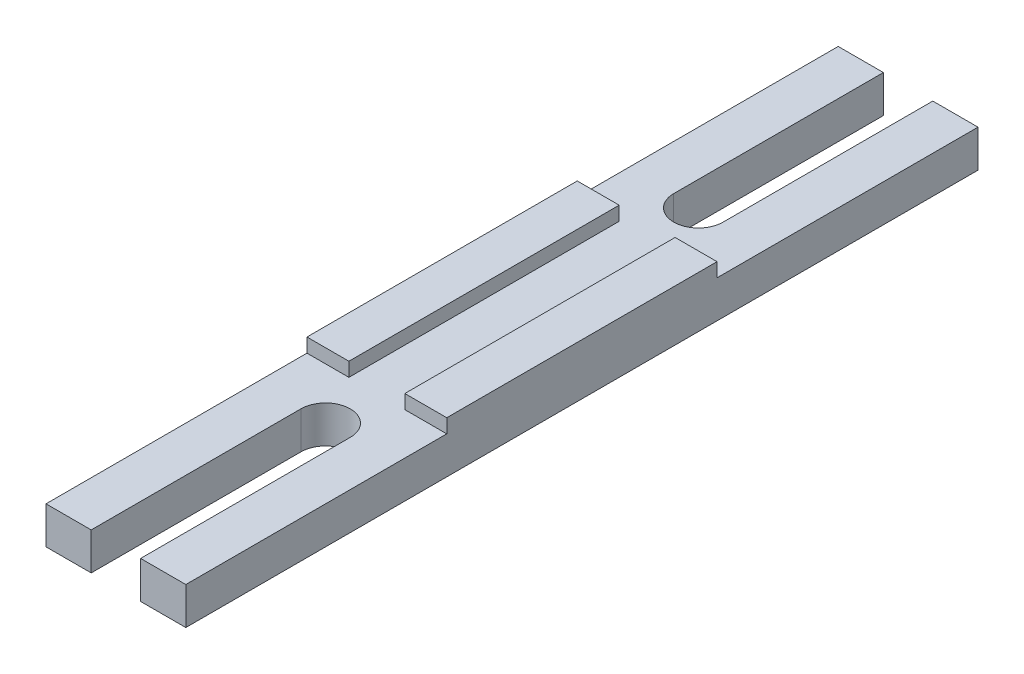
ISO-10303-21;
HEADER;
FILE_DESCRIPTION(('STEP AP214'),'2;1');
FILE_NAME('part.step','',(''),(''),'','','');
FILE_SCHEMA(('AUTOMOTIVE_DESIGN { 1 0 10303 214 1 1 1 1 }'));
ENDSEC;
DATA;
#1=APPLICATION_CONTEXT('core data for automotive mechanical design processes');
#2=APPLICATION_PROTOCOL_DEFINITION('international standard','automotive_design',2000,#1);
#3=PRODUCT_CONTEXT('',#1,'mechanical');
#4=PRODUCT('Part','Part','',(#3));
#5=PRODUCT_RELATED_PRODUCT_CATEGORY('part','',(#4));
#6=PRODUCT_DEFINITION_FORMATION('','',#4);
#7=PRODUCT_DEFINITION_CONTEXT('part definition',#1,'design');
#8=PRODUCT_DEFINITION('design','',#6,#7);
#9=PRODUCT_DEFINITION_SHAPE('','',#8);
#10=(LENGTH_UNIT() NAMED_UNIT(*) SI_UNIT(.MILLI.,.METRE.));
#11=(NAMED_UNIT(*) PLANE_ANGLE_UNIT() SI_UNIT($,.RADIAN.));
#12=(NAMED_UNIT(*) SI_UNIT($,.STERADIAN.) SOLID_ANGLE_UNIT());
#13=UNCERTAINTY_MEASURE_WITH_UNIT(LENGTH_MEASURE(1.E-05),#10,'distance_accuracy_value','');
#14=(GEOMETRIC_REPRESENTATION_CONTEXT(3) GLOBAL_UNCERTAINTY_ASSIGNED_CONTEXT((#13)) GLOBAL_UNIT_ASSIGNED_CONTEXT((#10,
#11,#12)) REPRESENTATION_CONTEXT('',''));
#15=CARTESIAN_POINT('',(0.,0.,0.));
#16=DIRECTION('',(0.,0.,1.));
#17=DIRECTION('',(1.,0.,0.));
#18=AXIS2_PLACEMENT_3D('',#15,#16,#17);
#19=CARTESIAN_POINT('',(-3.,4.,12.51));
#20=DIRECTION('',(-1.,0.,0.));
#21=DIRECTION('',(0.,-1.,0.));
#22=AXIS2_PLACEMENT_3D('',#19,#20,#21);
#23=PLANE('',#22);
#24=DIRECTION('',(0.,0.,-1.));
#25=VECTOR('',#24,1.);
#26=CARTESIAN_POINT('',(-3.,5.50000000000001,-29.5));
#27=LINE('',#26,#25);
#28=CARTESIAN_POINT('',(-3.,5.5,-0.500000000000002));
#29=VERTEX_POINT('',#28);
#30=CARTESIAN_POINT('',(-3.,5.5,-29.5));
#31=VERTEX_POINT('',#30);
#32=EDGE_CURVE('E331',#29,#31,#27,.T.);
#33=ORIENTED_EDGE('',*,*,#32,.F.);
#34=DIRECTION('',(0.,1.,0.));
#35=VECTOR('',#34,1.);
#36=CARTESIAN_POINT('',(-3.,5.5,-0.500000000000002));
#37=LINE('',#36,#35);
#38=CARTESIAN_POINT('',(-3.,3.99999999999999,-0.500000000000003));
#39=VERTEX_POINT('',#38);
#40=EDGE_CURVE('E196',#39,#29,#37,.T.);
#41=ORIENTED_EDGE('',*,*,#40,.F.);
#42=DIRECTION('',(0.,0.,-1.));
#43=VECTOR('',#42,1.);
#44=CARTESIAN_POINT('',(-3.,4.,12.51));
#45=LINE('',#44,#43);
#46=CARTESIAN_POINT('',(-3.,3.99999999999999,-29.5));
#47=VERTEX_POINT('',#46);
#48=EDGE_CURVE('E11',#39,#47,#45,.T.);
#49=ORIENTED_EDGE('',*,*,#48,.T.);
#50=DIRECTION('',(0.,-1.,0.));
#51=VECTOR('',#50,1.);
#52=CARTESIAN_POINT('',(-3.,12.7721259943546,-29.5));
#53=LINE('',#52,#51);
#54=EDGE_CURVE('E392',#31,#47,#53,.T.);
#55=ORIENTED_EDGE('',*,*,#54,.F.);
#56=EDGE_LOOP('',(#33,#41,#49,#55));
#57=FACE_BOUND('',#56,.T.);
#58=ADVANCED_FACE('F44',(#57),#23,.F.);
#59=CARTESIAN_POINT('',(3.,7.8079598766714,12.51));
#60=DIRECTION('',(1.,0.,0.));
#61=DIRECTION('',(0.,1.,0.));
#62=AXIS2_PLACEMENT_3D('',#59,#60,#61);
#63=PLANE('',#62);
#64=DIRECTION('',(0.,0.,-1.));
#65=VECTOR('',#64,1.);
#66=CARTESIAN_POINT('',(3.,5.50000000000001,-15.));
#67=LINE('',#66,#65);
#68=CARTESIAN_POINT('',(3.,5.5,-0.500000000000002));
#69=VERTEX_POINT('',#68);
#70=CARTESIAN_POINT('',(3.,5.50000000000001,-29.5));
#71=VERTEX_POINT('',#70);
#72=EDGE_CURVE('E332',#69,#71,#67,.T.);
#73=ORIENTED_EDGE('',*,*,#72,.T.);
#74=DIRECTION('',(0.,1.,0.));
#75=VECTOR('',#74,1.);
#76=CARTESIAN_POINT('',(3.,12.7721259943546,-29.5));
#77=LINE('',#76,#75);
#78=CARTESIAN_POINT('',(3.,3.99999999999999,-29.5));
#79=VERTEX_POINT('',#78);
#80=EDGE_CURVE('E62',#79,#71,#77,.T.);
#81=ORIENTED_EDGE('',*,*,#80,.F.);
#82=DIRECTION('',(0.,0.,-1.));
#83=VECTOR('',#82,1.);
#84=CARTESIAN_POINT('',(3.,4.,12.51));
#85=LINE('',#84,#83);
#86=CARTESIAN_POINT('',(3.,3.99999999999999,-0.500000000000003));
#87=VERTEX_POINT('',#86);
#88=EDGE_CURVE('E54',#87,#79,#85,.T.);
#89=ORIENTED_EDGE('',*,*,#88,.F.);
#90=DIRECTION('',(0.,-1.,0.));
#91=VECTOR('',#90,1.);
#92=CARTESIAN_POINT('',(3.,5.5,-0.500000000000002));
#93=LINE('',#92,#91);
#94=EDGE_CURVE('E48',#69,#87,#93,.T.);
#95=ORIENTED_EDGE('',*,*,#94,.F.);
#96=EDGE_LOOP('',(#73,#81,#89,#95));
#97=FACE_BOUND('',#96,.T.);
#98=ADVANCED_FACE('F46',(#97),#63,.F.);
#99=CARTESIAN_POINT('',(2.64999999999999,0.,15.));
#100=DIRECTION('',(1.,0.,0.));
#101=DIRECTION('',(0.,0.,-1.));
#102=AXIS2_PLACEMENT_3D('',#99,#100,#101);
#103=PLANE('',#102);
#104=DIRECTION('',(0.,0.,-1.));
#105=VECTOR('',#104,1.);
#106=CARTESIAN_POINT('',(2.65000000000004,0.,-30.));
#107=LINE('',#106,#105);
#108=CARTESIAN_POINT('',(2.65,0.,27.5));
#109=VERTEX_POINT('',#108);
#110=CARTESIAN_POINT('',(2.65,0.,5.));
#111=VERTEX_POINT('',#110);
#112=EDGE_CURVE('E203',#109,#111,#107,.T.);
#113=ORIENTED_EDGE('',*,*,#112,.F.);
#114=DIRECTION('',(0.,1.,0.));
#115=VECTOR('',#114,1.);
#116=CARTESIAN_POINT('',(2.65,-15.7645964109456,27.5));
#117=LINE('',#116,#115);
#118=CARTESIAN_POINT('',(2.65,3.99999999999999,27.5));
#119=VERTEX_POINT('',#118);
#120=EDGE_CURVE('E200',#109,#119,#117,.T.);
#121=ORIENTED_EDGE('',*,*,#120,.T.);
#122=DIRECTION('',(0.,0.,-1.));
#123=VECTOR('',#122,1.);
#124=CARTESIAN_POINT('',(2.64999999999999,4.,15.));
#125=LINE('',#124,#123);
#126=CARTESIAN_POINT('',(2.65,4.,5.));
#127=VERTEX_POINT('',#126);
#128=EDGE_CURVE('E184',#119,#127,#125,.T.);
#129=ORIENTED_EDGE('',*,*,#128,.T.);
#130=DIRECTION('',(0.,1.,0.));
#131=VECTOR('',#130,1.);
#132=CARTESIAN_POINT('',(2.65,0.,5.));
#133=LINE('',#132,#131);
#134=EDGE_CURVE('E362',#111,#127,#133,.T.);
#135=ORIENTED_EDGE('',*,*,#134,.F.);
#136=EDGE_LOOP('',(#113,#121,#129,#135));
#137=FACE_BOUND('',#136,.T.);
#138=ADVANCED_FACE('F201',(#137),#103,.F.);
#139=CARTESIAN_POINT('',(3.,5.5,-0.500000000000002));
#140=DIRECTION('',(0.,0.,-1.));
#141=DIRECTION('',(-1.,0.,0.));
#142=AXIS2_PLACEMENT_3D('',#139,#140,#141);
#143=PLANE('',#142);
#144=DIRECTION('',(1.,0.,0.));
#145=VECTOR('',#144,1.);
#146=CARTESIAN_POINT('',(-7.5,5.5,-0.500000000000002));
#147=LINE('',#146,#145);
#148=CARTESIAN_POINT('',(7.5,5.5,-0.500000000000002));
#149=VERTEX_POINT('',#148);
#150=EDGE_CURVE('E293',#69,#149,#147,.T.);
#151=ORIENTED_EDGE('',*,*,#150,.F.);
#152=ORIENTED_EDGE('',*,*,#94,.T.);
#153=DIRECTION('',(1.,0.,0.));
#154=VECTOR('',#153,1.);
#155=CARTESIAN_POINT('',(-7.5,3.99999999999999,-0.500000000000003));
#156=LINE('',#155,#154);
#157=CARTESIAN_POINT('',(7.5,3.99999999999999,-0.500000000000003));
#158=VERTEX_POINT('',#157);
#159=EDGE_CURVE('E281',#87,#158,#156,.T.);
#160=ORIENTED_EDGE('',*,*,#159,.T.);
#161=DIRECTION('',(0.,1.,0.));
#162=VECTOR('',#161,1.);
#163=CARTESIAN_POINT('',(7.5,5.5,-0.500000000000002));
#164=LINE('',#163,#162);
#165=EDGE_CURVE('E277',#158,#149,#164,.T.);
#166=ORIENTED_EDGE('',*,*,#165,.T.);
#167=EDGE_LOOP('',(#151,#152,#160,#166));
#168=FACE_BOUND('',#167,.T.);
#169=ADVANCED_FACE('F473',(#168),#143,.F.);
#170=CARTESIAN_POINT('',(0.,0.,-35.));
#171=DIRECTION('',(0.,1.,0.));
#172=DIRECTION('',(0.,0.,1.));
#173=AXIS2_PLACEMENT_3D('',#170,#171,#172);
#174=CYLINDRICAL_SURFACE('',#173,2.65);
#175=DIRECTION('',(0.,1.,0.));
#176=VECTOR('',#175,1.);
#177=CARTESIAN_POINT('',(-2.65,0.,-35.));
#178=LINE('',#177,#176);
#179=CARTESIAN_POINT('',(-2.64999999999999,0.,-35.));
#180=VERTEX_POINT('',#179);
#181=CARTESIAN_POINT('',(-2.64999999999999,4.,-35.));
#182=VERTEX_POINT('',#181);
#183=EDGE_CURVE('E347',#180,#182,#178,.T.);
#184=ORIENTED_EDGE('',*,*,#183,.T.);
#185=CARTESIAN_POINT('',(0.,4.,-35.));
#186=DIRECTION('',(0.,-1.,0.));
#187=DIRECTION('',(0.,0.,-1.));
#188=AXIS2_PLACEMENT_3D('',#185,#186,#187);
#189=CIRCLE('',#188,2.65);
#190=CARTESIAN_POINT('',(2.65,4.,-35.));
#191=VERTEX_POINT('',#190);
#192=EDGE_CURVE('E292',#182,#191,#189,.F.);
#193=ORIENTED_EDGE('',*,*,#192,.T.);
#194=DIRECTION('',(0.,1.,0.));
#195=VECTOR('',#194,1.);
#196=CARTESIAN_POINT('',(2.65,0.,-35.));
#197=LINE('',#196,#195);
#198=CARTESIAN_POINT('',(2.65,0.,-35.));
#199=VERTEX_POINT('',#198);
#200=EDGE_CURVE('E348',#199,#191,#197,.T.);
#201=ORIENTED_EDGE('',*,*,#200,.F.);
#202=CARTESIAN_POINT('',(0.,0.,-35.));
#203=DIRECTION('',(0.,1.,0.));
#204=DIRECTION('',(0.,0.,1.));
#205=AXIS2_PLACEMENT_3D('',#202,#203,#204);
#206=CIRCLE('',#205,2.65);
#207=EDGE_CURVE('E339',#180,#199,#206,.T.);
#208=ORIENTED_EDGE('',*,*,#207,.F.);
#209=EDGE_LOOP('',(#184,#193,#201,#208));
#210=FACE_BOUND('',#209,.T.);
#211=ADVANCED_FACE('F515',(#210),#174,.F.);
#212=CARTESIAN_POINT('',(2.64999999999999,0.,-45.));
#213=DIRECTION('',(1.,0.,0.));
#214=DIRECTION('',(0.,0.,-1.));
#215=AXIS2_PLACEMENT_3D('',#212,#213,#214);
#216=PLANE('',#215);
#217=ORIENTED_EDGE('',*,*,#200,.T.);
#218=DIRECTION('',(0.,0.,-1.));
#219=VECTOR('',#218,1.);
#220=CARTESIAN_POINT('',(2.64999999999999,4.,-45.));
#221=LINE('',#220,#219);
#222=CARTESIAN_POINT('',(2.65,3.99999999999999,-57.5));
#223=VERTEX_POINT('',#222);
#224=EDGE_CURVE('E323',#191,#223,#221,.T.);
#225=ORIENTED_EDGE('',*,*,#224,.T.);
#226=DIRECTION('',(0.,1.,0.));
#227=VECTOR('',#226,1.);
#228=CARTESIAN_POINT('',(2.65,-15.7645964109456,-57.5));
#229=LINE('',#228,#227);
#230=CARTESIAN_POINT('',(2.65,0.,-57.5));
#231=VERTEX_POINT('',#230);
#232=EDGE_CURVE('E245',#231,#223,#229,.T.);
#233=ORIENTED_EDGE('',*,*,#232,.F.);
#234=DIRECTION('',(0.,0.,-1.));
#235=VECTOR('',#234,1.);
#236=CARTESIAN_POINT('',(2.64999999999999,0.,-45.));
#237=LINE('',#236,#235);
#238=EDGE_CURVE('E343',#199,#231,#237,.T.);
#239=ORIENTED_EDGE('',*,*,#238,.F.);
#240=EDGE_LOOP('',(#217,#225,#233,#239));
#241=FACE_BOUND('',#240,.T.);
#242=ADVANCED_FACE('F507',(#241),#216,.F.);
#243=CARTESIAN_POINT('',(3.175,0.,-30.));
#244=DIRECTION('',(0.,1.,0.));
#245=DIRECTION('',(0.,0.,1.));
#246=AXIS2_PLACEMENT_3D('',#243,#244,#245);
#247=PLANE('',#246);
#248=ORIENTED_EDGE('',*,*,#207,.T.);
#249=ORIENTED_EDGE('',*,*,#238,.T.);
#250=DIRECTION('',(1.,0.,0.));
#251=VECTOR('',#250,1.);
#252=CARTESIAN_POINT('',(2.65,0.,-57.5));
#253=LINE('',#252,#251);
#254=CARTESIAN_POINT('',(7.5,0.,-57.5));
#255=VERTEX_POINT('',#254);
#256=EDGE_CURVE('E240',#231,#255,#253,.T.);
#257=ORIENTED_EDGE('',*,*,#256,.T.);
#258=DIRECTION('',(0.,0.,1.));
#259=VECTOR('',#258,1.);
#260=CARTESIAN_POINT('',(7.5,0.,-42.5));
#261=LINE('',#260,#259);
#262=CARTESIAN_POINT('',(7.5,0.,27.5));
#263=VERTEX_POINT('',#262);
#264=EDGE_CURVE('E372',#255,#263,#261,.T.);
#265=ORIENTED_EDGE('',*,*,#264,.T.);
#266=DIRECTION('',(-1.,0.,0.));
#267=VECTOR('',#266,1.);
#268=CARTESIAN_POINT('',(7.5,0.,27.5));
#269=LINE('',#268,#267);
#270=EDGE_CURVE('E220',#263,#109,#269,.T.);
#271=ORIENTED_EDGE('',*,*,#270,.T.);
#272=ORIENTED_EDGE('',*,*,#112,.T.);
#273=CARTESIAN_POINT('',(0.,0.,5.));
#274=DIRECTION('',(0.,1.,0.));
#275=DIRECTION('',(0.,0.,-1.));
#276=AXIS2_PLACEMENT_3D('',#273,#274,#275);
#277=CIRCLE('',#276,2.65);
#278=CARTESIAN_POINT('',(-2.65,0.,5.));
#279=VERTEX_POINT('',#278);
#280=EDGE_CURVE('E338',#111,#279,#277,.T.);
#281=ORIENTED_EDGE('',*,*,#280,.T.);
#282=DIRECTION('',(0.,0.,1.));
#283=VECTOR('',#282,1.);
#284=CARTESIAN_POINT('',(-2.64999999999997,0.,15.));
#285=LINE('',#284,#283);
#286=CARTESIAN_POINT('',(-2.65,0.,27.5));
#287=VERTEX_POINT('',#286);
#288=EDGE_CURVE('E359',#279,#287,#285,.T.);
#289=ORIENTED_EDGE('',*,*,#288,.T.);
#290=DIRECTION('',(-1.,0.,0.));
#291=VECTOR('',#290,1.);
#292=CARTESIAN_POINT('',(-2.65,0.,27.5));
#293=LINE('',#292,#291);
#294=CARTESIAN_POINT('',(-7.5,0.,27.5));
#295=VERTEX_POINT('',#294);
#296=EDGE_CURVE('E223',#287,#295,#293,.T.);
#297=ORIENTED_EDGE('',*,*,#296,.T.);
#298=DIRECTION('',(0.,0.,-1.));
#299=VECTOR('',#298,1.);
#300=CARTESIAN_POINT('',(-7.5,0.,-42.5));
#301=LINE('',#300,#299);
#302=CARTESIAN_POINT('',(-7.5,0.,-57.5));
#303=VERTEX_POINT('',#302);
#304=EDGE_CURVE('E352',#295,#303,#301,.T.);
#305=ORIENTED_EDGE('',*,*,#304,.T.);
#306=DIRECTION('',(1.,0.,0.));
#307=VECTOR('',#306,1.);
#308=CARTESIAN_POINT('',(-7.5,0.,-57.5));
#309=LINE('',#308,#307);
#310=CARTESIAN_POINT('',(-2.64999999999998,0.,-57.5));
#311=VERTEX_POINT('',#310);
#312=EDGE_CURVE('E256',#303,#311,#309,.T.);
#313=ORIENTED_EDGE('',*,*,#312,.T.);
#314=DIRECTION('',(0.,0.,1.));
#315=VECTOR('',#314,1.);
#316=CARTESIAN_POINT('',(-2.65,0.,-30.));
#317=LINE('',#316,#315);
#318=EDGE_CURVE('E382',#311,#180,#317,.T.);
#319=ORIENTED_EDGE('',*,*,#318,.T.);
#320=EDGE_LOOP('',(#248,#249,#257,#265,#271,#272,#281,#289,#297,#305,#313,#319));
#321=FACE_BOUND('',#320,.T.);
#322=ADVANCED_FACE('F505',(#321),#247,.F.);
#323=CARTESIAN_POINT('',(-2.64999999999997,0.,-45.));
#324=DIRECTION('',(-1.,0.,0.));
#325=DIRECTION('',(0.,0.,1.));
#326=AXIS2_PLACEMENT_3D('',#323,#324,#325);
#327=PLANE('',#326);
#328=ORIENTED_EDGE('',*,*,#318,.F.);
#329=DIRECTION('',(0.,1.,0.));
#330=VECTOR('',#329,1.);
#331=CARTESIAN_POINT('',(-2.64999999999998,-15.7645964109456,-57.5));
#332=LINE('',#331,#330);
#333=CARTESIAN_POINT('',(-2.64999999999998,3.99999999999999,-57.5));
#334=VERTEX_POINT('',#333);
#335=EDGE_CURVE('E265',#311,#334,#332,.T.);
#336=ORIENTED_EDGE('',*,*,#335,.T.);
#337=DIRECTION('',(0.,0.,1.));
#338=VECTOR('',#337,1.);
#339=CARTESIAN_POINT('',(-2.64999999999997,4.,-45.));
#340=LINE('',#339,#338);
#341=EDGE_CURVE('E197',#334,#182,#340,.T.);
#342=ORIENTED_EDGE('',*,*,#341,.T.);
#343=ORIENTED_EDGE('',*,*,#183,.F.);
#344=EDGE_LOOP('',(#328,#336,#342,#343));
#345=FACE_BOUND('',#344,.T.);
#346=ADVANCED_FACE('F503',(#345),#327,.F.);
#347=CARTESIAN_POINT('',(-7.5,5.5,-42.5));
#348=DIRECTION('',(-1.,0.,0.));
#349=DIRECTION('',(0.,0.,1.));
#350=AXIS2_PLACEMENT_3D('',#347,#348,#349);
#351=PLANE('',#350);
#352=DIRECTION('',(0.,1.,0.));
#353=VECTOR('',#352,1.);
#354=CARTESIAN_POINT('',(-7.5,5.5,-0.500000000000002));
#355=LINE('',#354,#353);
#356=CARTESIAN_POINT('',(-7.5,3.99999999999999,-0.500000000000003));
#357=VERTEX_POINT('',#356);
#358=CARTESIAN_POINT('',(-7.5,5.5,-0.500000000000002));
#359=VERTEX_POINT('',#358);
#360=EDGE_CURVE('E276',#357,#359,#355,.T.);
#361=ORIENTED_EDGE('',*,*,#360,.T.);
#362=DIRECTION('',(0.,0.,-1.));
#363=VECTOR('',#362,1.);
#364=CARTESIAN_POINT('',(-7.5,5.5,-42.5));
#365=LINE('',#364,#363);
#366=CARTESIAN_POINT('',(-7.5,5.50000000000001,-29.5));
#367=VERTEX_POINT('',#366);
#368=EDGE_CURVE('E367',#359,#367,#365,.T.);
#369=ORIENTED_EDGE('',*,*,#368,.T.);
#370=DIRECTION('',(0.,-1.,0.));
#371=VECTOR('',#370,1.);
#372=CARTESIAN_POINT('',(-7.5,5.50000000000001,-29.5));
#373=LINE('',#372,#371);
#374=CARTESIAN_POINT('',(-7.5,3.99999999999999,-29.5));
#375=VERTEX_POINT('',#374);
#376=EDGE_CURVE('E298',#367,#375,#373,.T.);
#377=ORIENTED_EDGE('',*,*,#376,.T.);
#378=DIRECTION('',(0.,0.,-1.));
#379=VECTOR('',#378,1.);
#380=CARTESIAN_POINT('',(-7.5,4.,-42.5));
#381=LINE('',#380,#379);
#382=CARTESIAN_POINT('',(-7.5,3.99999999999999,-57.5));
#383=VERTEX_POINT('',#382);
#384=EDGE_CURVE('E302',#375,#383,#381,.T.);
#385=ORIENTED_EDGE('',*,*,#384,.T.);
#386=DIRECTION('',(0.,1.,0.));
#387=VECTOR('',#386,1.);
#388=CARTESIAN_POINT('',(-7.5,-15.7645964109456,-57.5));
#389=LINE('',#388,#387);
#390=EDGE_CURVE('E261',#303,#383,#389,.T.);
#391=ORIENTED_EDGE('',*,*,#390,.F.);
#392=ORIENTED_EDGE('',*,*,#304,.F.);
#393=DIRECTION('',(0.,1.,0.));
#394=VECTOR('',#393,1.);
#395=CARTESIAN_POINT('',(-7.5,-15.7645964109456,27.5));
#396=LINE('',#395,#394);
#397=CARTESIAN_POINT('',(-7.5,3.99999999999999,27.5));
#398=VERTEX_POINT('',#397);
#399=EDGE_CURVE('E233',#295,#398,#396,.T.);
#400=ORIENTED_EDGE('',*,*,#399,.T.);
#401=DIRECTION('',(0.,0.,-1.));
#402=VECTOR('',#401,1.);
#403=CARTESIAN_POINT('',(-7.5,4.,12.5));
#404=LINE('',#403,#402);
#405=EDGE_CURVE('E272',#398,#357,#404,.T.);
#406=ORIENTED_EDGE('',*,*,#405,.T.);
#407=EDGE_LOOP('',(#361,#369,#377,#385,#391,#392,#400,#406));
#408=FACE_BOUND('',#407,.T.);
#409=ADVANCED_FACE('F500',(#408),#351,.T.);
#410=CARTESIAN_POINT('',(3.,12.7721259943546,-29.5));
#411=DIRECTION('',(0.,0.,1.));
#412=DIRECTION('',(1.,0.,0.));
#413=AXIS2_PLACEMENT_3D('',#410,#411,#412);
#414=PLANE('',#413);
#415=DIRECTION('',(1.,0.,0.));
#416=VECTOR('',#415,1.);
#417=CARTESIAN_POINT('',(-7.5,5.50000000000001,-29.5));
#418=LINE('',#417,#416);
#419=EDGE_CURVE('E316',#367,#31,#418,.T.);
#420=ORIENTED_EDGE('',*,*,#419,.T.);
#421=ORIENTED_EDGE('',*,*,#54,.T.);
#422=DIRECTION('',(1.,0.,0.));
#423=VECTOR('',#422,1.);
#424=CARTESIAN_POINT('',(-7.5,3.99999999999999,-29.5));
#425=LINE('',#424,#423);
#426=EDGE_CURVE('E285',#375,#47,#425,.T.);
#427=ORIENTED_EDGE('',*,*,#426,.F.);
#428=ORIENTED_EDGE('',*,*,#376,.F.);
#429=EDGE_LOOP('',(#420,#421,#427,#428));
#430=FACE_BOUND('',#429,.T.);
#431=ADVANCED_FACE('F499',(#430),#414,.F.);
#432=CARTESIAN_POINT('',(7.5,5.5,-42.5));
#433=DIRECTION('',(1.,0.,0.));
#434=DIRECTION('',(0.,0.,-1.));
#435=AXIS2_PLACEMENT_3D('',#432,#433,#434);
#436=PLANE('',#435);
#437=ORIENTED_EDGE('',*,*,#165,.F.);
#438=DIRECTION('',(0.,0.,-1.));
#439=VECTOR('',#438,1.);
#440=CARTESIAN_POINT('',(7.5,4.,12.5));
#441=LINE('',#440,#439);
#442=CARTESIAN_POINT('',(7.5,3.99999999999999,27.5));
#443=VERTEX_POINT('',#442);
#444=EDGE_CURVE('E282',#443,#158,#441,.T.);
#445=ORIENTED_EDGE('',*,*,#444,.F.);
#446=DIRECTION('',(0.,1.,0.));
#447=VECTOR('',#446,1.);
#448=CARTESIAN_POINT('',(7.5,-15.7645964109456,27.5));
#449=LINE('',#448,#447);
#450=EDGE_CURVE('E208',#263,#443,#449,.T.);
#451=ORIENTED_EDGE('',*,*,#450,.F.);
#452=ORIENTED_EDGE('',*,*,#264,.F.);
#453=DIRECTION('',(0.,1.,0.));
#454=VECTOR('',#453,1.);
#455=CARTESIAN_POINT('',(7.5,-15.7645964109456,-57.5));
#456=LINE('',#455,#454);
#457=CARTESIAN_POINT('',(7.5,3.99999999999999,-57.5));
#458=VERTEX_POINT('',#457);
#459=EDGE_CURVE('E249',#255,#458,#456,.T.);
#460=ORIENTED_EDGE('',*,*,#459,.T.);
#461=DIRECTION('',(0.,0.,-1.));
#462=VECTOR('',#461,1.);
#463=CARTESIAN_POINT('',(7.5,4.,-42.5));
#464=LINE('',#463,#462);
#465=CARTESIAN_POINT('',(7.5,3.99999999999999,-29.5));
#466=VERTEX_POINT('',#465);
#467=EDGE_CURVE('E303',#466,#458,#464,.T.);
#468=ORIENTED_EDGE('',*,*,#467,.F.);
#469=DIRECTION('',(0.,-1.,0.));
#470=VECTOR('',#469,1.);
#471=CARTESIAN_POINT('',(7.5,5.50000000000001,-29.5));
#472=LINE('',#471,#470);
#473=CARTESIAN_POINT('',(7.5,5.50000000000001,-29.5));
#474=VERTEX_POINT('',#473);
#475=EDGE_CURVE('E260',#474,#466,#472,.T.);
#476=ORIENTED_EDGE('',*,*,#475,.F.);
#477=DIRECTION('',(0.,0.,1.));
#478=VECTOR('',#477,1.);
#479=CARTESIAN_POINT('',(7.5,5.5,-42.5));
#480=LINE('',#479,#478);
#481=EDGE_CURVE('E371',#474,#149,#480,.T.);
#482=ORIENTED_EDGE('',*,*,#481,.T.);
#483=EDGE_LOOP('',(#437,#445,#451,#452,#460,#468,#476,#482));
#484=FACE_BOUND('',#483,.T.);
#485=ADVANCED_FACE('F469',(#484),#436,.T.);
#486=EDGE_CURVE('E315',#79,#466,#425,.T.);
#487=ORIENTED_EDGE('',*,*,#486,.F.);
#488=ORIENTED_EDGE('',*,*,#80,.T.);
#489=EDGE_CURVE('E306',#71,#474,#418,.T.);
#490=ORIENTED_EDGE('',*,*,#489,.T.);
#491=ORIENTED_EDGE('',*,*,#475,.T.);
#492=EDGE_LOOP('',(#487,#488,#490,#491));
#493=FACE_BOUND('',#492,.T.);
#494=ADVANCED_FACE('F463',(#493),#414,.F.);
#495=EDGE_CURVE('E294',#357,#39,#156,.T.);
#496=ORIENTED_EDGE('',*,*,#495,.T.);
#497=ORIENTED_EDGE('',*,*,#40,.T.);
#498=EDGE_CURVE('E288',#359,#29,#147,.T.);
#499=ORIENTED_EDGE('',*,*,#498,.F.);
#500=ORIENTED_EDGE('',*,*,#360,.F.);
#501=EDGE_LOOP('',(#496,#497,#499,#500));
#502=FACE_BOUND('',#501,.T.);
#503=ADVANCED_FACE('F547',(#502),#143,.F.);
#504=CARTESIAN_POINT('',(-7.5,4.,12.5));
#505=DIRECTION('',(0.,-1.,0.));
#506=DIRECTION('',(0.,0.,-1.));
#507=AXIS2_PLACEMENT_3D('',#504,#505,#506);
#508=PLANE('',#507);
#509=ORIENTED_EDGE('',*,*,#405,.F.);
#510=DIRECTION('',(1.,0.,0.));
#511=VECTOR('',#510,1.);
#512=CARTESIAN_POINT('',(-2.65,3.99999999999999,27.5));
#513=LINE('',#512,#511);
#514=CARTESIAN_POINT('',(-2.65,3.99999999999999,27.5));
#515=VERTEX_POINT('',#514);
#516=EDGE_CURVE('E229',#398,#515,#513,.T.);
#517=ORIENTED_EDGE('',*,*,#516,.T.);
#518=DIRECTION('',(0.,0.,1.));
#519=VECTOR('',#518,1.);
#520=CARTESIAN_POINT('',(-2.64999999999997,4.,15.));
#521=LINE('',#520,#519);
#522=CARTESIAN_POINT('',(-2.65,4.,5.));
#523=VERTEX_POINT('',#522);
#524=EDGE_CURVE('E328',#523,#515,#521,.T.);
#525=ORIENTED_EDGE('',*,*,#524,.F.);
#526=CARTESIAN_POINT('',(0.,4.,5.));
#527=DIRECTION('',(0.,-1.,0.));
#528=DIRECTION('',(0.,0.,-1.));
#529=AXIS2_PLACEMENT_3D('',#526,#527,#528);
#530=CIRCLE('',#529,2.65);
#531=EDGE_CURVE('E191',#127,#523,#530,.F.);
#532=ORIENTED_EDGE('',*,*,#531,.F.);
#533=ORIENTED_EDGE('',*,*,#128,.F.);
#534=DIRECTION('',(1.,0.,0.));
#535=VECTOR('',#534,1.);
#536=CARTESIAN_POINT('',(7.5,3.99999999999999,27.5));
#537=LINE('',#536,#535);
#538=EDGE_CURVE('E189',#119,#443,#537,.T.);
#539=ORIENTED_EDGE('',*,*,#538,.T.);
#540=ORIENTED_EDGE('',*,*,#444,.T.);
#541=ORIENTED_EDGE('',*,*,#159,.F.);
#542=ORIENTED_EDGE('',*,*,#88,.T.);
#543=ORIENTED_EDGE('',*,*,#486,.T.);
#544=ORIENTED_EDGE('',*,*,#467,.T.);
#545=DIRECTION('',(-1.,0.,0.));
#546=VECTOR('',#545,1.);
#547=CARTESIAN_POINT('',(2.65,3.99999999999999,-57.5));
#548=LINE('',#547,#546);
#549=EDGE_CURVE('E227',#458,#223,#548,.T.);
#550=ORIENTED_EDGE('',*,*,#549,.T.);
#551=ORIENTED_EDGE('',*,*,#224,.F.);
#552=ORIENTED_EDGE('',*,*,#192,.F.);
#553=ORIENTED_EDGE('',*,*,#341,.F.);
#554=DIRECTION('',(-1.,0.,0.));
#555=VECTOR('',#554,1.);
#556=CARTESIAN_POINT('',(-7.5,3.99999999999999,-57.5));
#557=LINE('',#556,#555);
#558=EDGE_CURVE('E244',#334,#383,#557,.T.);
#559=ORIENTED_EDGE('',*,*,#558,.T.);
#560=ORIENTED_EDGE('',*,*,#384,.F.);
#561=ORIENTED_EDGE('',*,*,#426,.T.);
#562=ORIENTED_EDGE('',*,*,#48,.F.);
#563=ORIENTED_EDGE('',*,*,#495,.F.);
#564=EDGE_LOOP('',(#509,#517,#525,#532,#533,#539,#540,#541,#542,#543,#544,#550,#551,#552,#553,
#559,#560,#561,#562,#563));
#565=FACE_BOUND('',#564,.T.);
#566=ADVANCED_FACE('F186',(#565),#508,.F.);
#567=CARTESIAN_POINT('',(0.,0.,5.));
#568=DIRECTION('',(0.,1.,0.));
#569=DIRECTION('',(0.,0.,1.));
#570=AXIS2_PLACEMENT_3D('',#567,#568,#569);
#571=CYLINDRICAL_SURFACE('',#570,2.65);
#572=ORIENTED_EDGE('',*,*,#134,.T.);
#573=ORIENTED_EDGE('',*,*,#531,.T.);
#574=DIRECTION('',(0.,1.,0.));
#575=VECTOR('',#574,1.);
#576=CARTESIAN_POINT('',(-2.65,0.,5.));
#577=LINE('',#576,#575);
#578=EDGE_CURVE('E344',#279,#523,#577,.T.);
#579=ORIENTED_EDGE('',*,*,#578,.F.);
#580=ORIENTED_EDGE('',*,*,#280,.F.);
#581=EDGE_LOOP('',(#572,#573,#579,#580));
#582=FACE_BOUND('',#581,.T.);
#583=ADVANCED_FACE('F532',(#582),#571,.F.);
#584=CARTESIAN_POINT('',(-2.64999999999997,0.,15.));
#585=DIRECTION('',(-1.,0.,0.));
#586=DIRECTION('',(0.,0.,1.));
#587=AXIS2_PLACEMENT_3D('',#584,#585,#586);
#588=PLANE('',#587);
#589=ORIENTED_EDGE('',*,*,#578,.T.);
#590=ORIENTED_EDGE('',*,*,#524,.T.);
#591=DIRECTION('',(0.,1.,0.));
#592=VECTOR('',#591,1.);
#593=CARTESIAN_POINT('',(-2.65,-15.7645964109456,27.5));
#594=LINE('',#593,#592);
#595=EDGE_CURVE('E228',#287,#515,#594,.T.);
#596=ORIENTED_EDGE('',*,*,#595,.F.);
#597=ORIENTED_EDGE('',*,*,#288,.F.);
#598=EDGE_LOOP('',(#589,#590,#596,#597));
#599=FACE_BOUND('',#598,.T.);
#600=ADVANCED_FACE('F493',(#599),#588,.F.);
#601=CARTESIAN_POINT('',(0.,5.5,0.));
#602=DIRECTION('',(0.,-1.,0.));
#603=DIRECTION('',(0.,0.,-1.));
#604=AXIS2_PLACEMENT_3D('',#601,#602,#603);
#605=PLANE('',#604);
#606=ORIENTED_EDGE('',*,*,#368,.F.);
#607=ORIENTED_EDGE('',*,*,#498,.T.);
#608=ORIENTED_EDGE('',*,*,#32,.T.);
#609=ORIENTED_EDGE('',*,*,#419,.F.);
#610=EDGE_LOOP('',(#606,#607,#608,#609));
#611=FACE_BOUND('',#610,.T.);
#612=ADVANCED_FACE('F484',(#611),#605,.F.);
#613=ORIENTED_EDGE('',*,*,#72,.F.);
#614=ORIENTED_EDGE('',*,*,#150,.T.);
#615=ORIENTED_EDGE('',*,*,#481,.F.);
#616=ORIENTED_EDGE('',*,*,#489,.F.);
#617=EDGE_LOOP('',(#613,#614,#615,#616));
#618=FACE_BOUND('',#617,.T.);
#619=ADVANCED_FACE('F470',(#618),#605,.F.);
#620=CARTESIAN_POINT('',(-7.5,-15.7645964109456,-57.5));
#621=DIRECTION('',(0.,0.,-1.));
#622=DIRECTION('',(-1.,0.,0.));
#623=AXIS2_PLACEMENT_3D('',#620,#621,#622);
#624=PLANE('',#623);
#625=ORIENTED_EDGE('',*,*,#312,.F.);
#626=ORIENTED_EDGE('',*,*,#390,.T.);
#627=ORIENTED_EDGE('',*,*,#558,.F.);
#628=ORIENTED_EDGE('',*,*,#335,.F.);
#629=EDGE_LOOP('',(#625,#626,#627,#628));
#630=FACE_BOUND('',#629,.T.);
#631=ADVANCED_FACE('F481',(#630),#624,.T.);
#632=CARTESIAN_POINT('',(2.65,-15.7645964109456,-57.5));
#633=DIRECTION('',(0.,0.,-1.));
#634=DIRECTION('',(-1.,0.,0.));
#635=AXIS2_PLACEMENT_3D('',#632,#633,#634);
#636=PLANE('',#635);
#637=ORIENTED_EDGE('',*,*,#256,.F.);
#638=ORIENTED_EDGE('',*,*,#232,.T.);
#639=ORIENTED_EDGE('',*,*,#549,.F.);
#640=ORIENTED_EDGE('',*,*,#459,.F.);
#641=EDGE_LOOP('',(#637,#638,#639,#640));
#642=FACE_BOUND('',#641,.T.);
#643=ADVANCED_FACE('F490',(#642),#636,.T.);
#644=CARTESIAN_POINT('',(-2.65,-15.7645964109456,27.5));
#645=DIRECTION('',(0.,0.,1.));
#646=DIRECTION('',(1.,0.,0.));
#647=AXIS2_PLACEMENT_3D('',#644,#645,#646);
#648=PLANE('',#647);
#649=ORIENTED_EDGE('',*,*,#296,.F.);
#650=ORIENTED_EDGE('',*,*,#595,.T.);
#651=ORIENTED_EDGE('',*,*,#516,.F.);
#652=ORIENTED_EDGE('',*,*,#399,.F.);
#653=EDGE_LOOP('',(#649,#650,#651,#652));
#654=FACE_BOUND('',#653,.T.);
#655=ADVANCED_FACE('F537',(#654),#648,.T.);
#656=CARTESIAN_POINT('',(7.5,-15.7645964109456,27.5));
#657=DIRECTION('',(0.,0.,1.));
#658=DIRECTION('',(1.,0.,0.));
#659=AXIS2_PLACEMENT_3D('',#656,#657,#658);
#660=PLANE('',#659);
#661=ORIENTED_EDGE('',*,*,#270,.F.);
#662=ORIENTED_EDGE('',*,*,#450,.T.);
#663=ORIENTED_EDGE('',*,*,#538,.F.);
#664=ORIENTED_EDGE('',*,*,#120,.F.);
#665=EDGE_LOOP('',(#661,#662,#663,#664));
#666=FACE_BOUND('',#665,.T.);
#667=ADVANCED_FACE('F211',(#666),#660,.T.);
#668=CLOSED_SHELL('',(#58,#98,#138,#169,#211,#242,#322,#346,#409,#431,#485,#494,#503,#566,#583,
#600,#612,#619,#631,#643,#655,#667));
#669=MANIFOLD_SOLID_BREP('B2',#668);
#670=ADVANCED_BREP_SHAPE_REPRESENTATION('',(#18,#669),#14);
#671=SHAPE_DEFINITION_REPRESENTATION(#9,#670);
ENDSEC;
END-ISO-10303-21;
